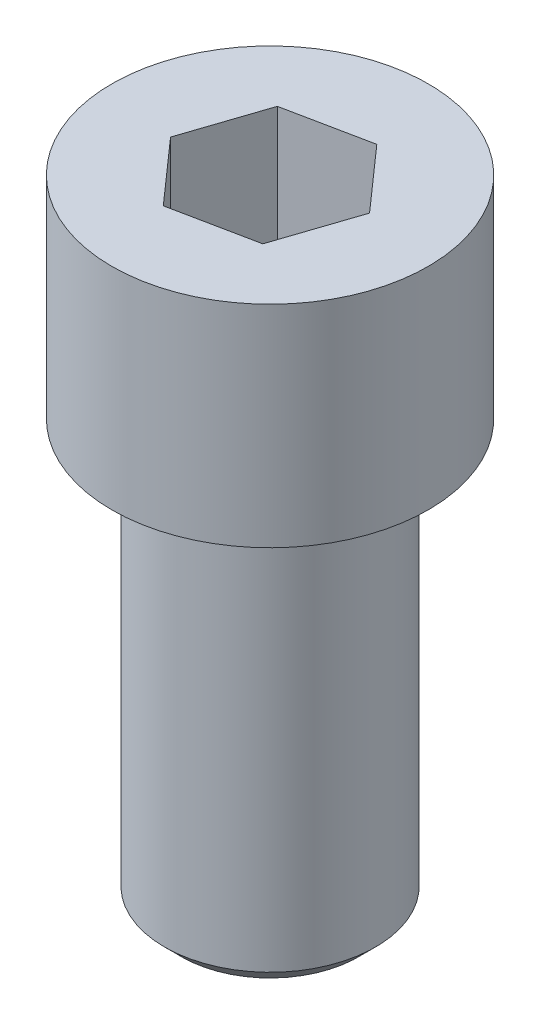
ISO-10303-21;
HEADER;
FILE_DESCRIPTION(('STEP AP214'),'2;1');
FILE_NAME('part.step','',(''),(''),'','','');
FILE_SCHEMA(('AUTOMOTIVE_DESIGN { 1 0 10303 214 1 1 1 1 }'));
ENDSEC;
DATA;
#1=APPLICATION_CONTEXT('core data for automotive mechanical design processes');
#2=APPLICATION_PROTOCOL_DEFINITION('international standard','automotive_design',2000,#1);
#3=PRODUCT_CONTEXT('',#1,'mechanical');
#4=PRODUCT('Part','Part','',(#3));
#5=PRODUCT_RELATED_PRODUCT_CATEGORY('part','',(#4));
#6=PRODUCT_DEFINITION_FORMATION('','',#4);
#7=PRODUCT_DEFINITION_CONTEXT('part definition',#1,'design');
#8=PRODUCT_DEFINITION('design','',#6,#7);
#9=PRODUCT_DEFINITION_SHAPE('','',#8);
#10=(LENGTH_UNIT() NAMED_UNIT(*) SI_UNIT(.MILLI.,.METRE.));
#11=(NAMED_UNIT(*) PLANE_ANGLE_UNIT() SI_UNIT($,.RADIAN.));
#12=(NAMED_UNIT(*) SI_UNIT($,.STERADIAN.) SOLID_ANGLE_UNIT());
#13=UNCERTAINTY_MEASURE_WITH_UNIT(LENGTH_MEASURE(1.E-05),#10,'distance_accuracy_value','');
#14=(GEOMETRIC_REPRESENTATION_CONTEXT(3) GLOBAL_UNCERTAINTY_ASSIGNED_CONTEXT((#13)) GLOBAL_UNIT_ASSIGNED_CONTEXT((#10,
#11,#12)) REPRESENTATION_CONTEXT('',''));
#15=CARTESIAN_POINT('',(0.,0.,0.));
#16=DIRECTION('',(0.,0.,1.));
#17=DIRECTION('',(1.,0.,0.));
#18=AXIS2_PLACEMENT_3D('',#15,#16,#17);
#19=CARTESIAN_POINT('',(0.,2.5,0.));
#20=DIRECTION('',(0.,-1.,0.));
#21=DIRECTION('',(0.,0.,-1.));
#22=AXIS2_PLACEMENT_3D('',#19,#20,#21);
#23=CYLINDRICAL_SURFACE('',#22,1.875);
#24=CARTESIAN_POINT('',(0.,2.5,0.));
#25=DIRECTION('',(0.,1.,0.));
#26=DIRECTION('',(0.,0.,1.));
#27=AXIS2_PLACEMENT_3D('',#24,#25,#26);
#28=CIRCLE('',#27,1.875);
#29=CARTESIAN_POINT('',(0.,2.5,1.875));
#30=VERTEX_POINT('',#29);
#31=EDGE_CURVE('E167',#30,#30,#28,.T.);
#32=ORIENTED_EDGE('',*,*,#31,.F.);
#33=EDGE_LOOP('',(#32));
#34=FACE_BOUND('',#33,.T.);
#35=CARTESIAN_POINT('',(0.,0.,0.));
#36=DIRECTION('',(0.,1.,0.));
#37=DIRECTION('',(0.,0.,1.));
#38=AXIS2_PLACEMENT_3D('',#35,#36,#37);
#39=CIRCLE('',#38,1.875);
#40=CARTESIAN_POINT('',(0.,0.,1.875));
#41=VERTEX_POINT('',#40);
#42=EDGE_CURVE('E157',#41,#41,#39,.T.);
#43=ORIENTED_EDGE('',*,*,#42,.T.);
#44=EDGE_LOOP('',(#43));
#45=FACE_BOUND('',#44,.T.);
#46=ADVANCED_FACE('F41',(#34,#45),#23,.T.);
#47=CARTESIAN_POINT('',(0.,2.5,0.));
#48=DIRECTION('',(0.,1.,0.));
#49=DIRECTION('',(0.,0.,1.));
#50=AXIS2_PLACEMENT_3D('',#47,#48,#49);
#51=PLANE('',#50);
#52=DIRECTION('',(-0.317225802511598,0.,0.948350035704577));
#53=VECTOR('',#52,1.);
#54=CARTESIAN_POINT('',(-0.662682321344245,2.5,-0.748900621563238));
#55=LINE('',#54,#53);
#56=CARTESIAN_POINT('',(-0.662682321344245,2.5,-0.748900621563238));
#57=VERTEX_POINT('',#56);
#58=CARTESIAN_POINT('',(-0.979908123855842,2.5,0.199449414141339));
#59=VERTEX_POINT('',#58);
#60=EDGE_CURVE('E58',#57,#59,#55,.T.);
#61=ORIENTED_EDGE('',*,*,#60,.F.);
#62=DIRECTION('',(-0.979908123855842,0.,0.199449414141339));
#63=VECTOR('',#62,1.);
#64=CARTESIAN_POINT('',(0.317225802511598,2.5,-0.948350035704577));
#65=LINE('',#64,#63);
#66=CARTESIAN_POINT('',(0.317225802511598,2.5,-0.948350035704577));
#67=VERTEX_POINT('',#66);
#68=EDGE_CURVE('E151',#67,#57,#65,.T.);
#69=ORIENTED_EDGE('',*,*,#68,.F.);
#70=DIRECTION('',(-0.662682321344244,0.,-0.748900621563238));
#71=VECTOR('',#70,1.);
#72=CARTESIAN_POINT('',(0.979908123855842,2.5,-0.199449414141339));
#73=LINE('',#72,#71);
#74=CARTESIAN_POINT('',(0.979908123855842,2.5,-0.199449414141339));
#75=VERTEX_POINT('',#74);
#76=EDGE_CURVE('E148',#75,#67,#73,.T.);
#77=ORIENTED_EDGE('',*,*,#76,.F.);
#78=DIRECTION('',(0.317225802511598,0.,-0.948350035704577));
#79=VECTOR('',#78,1.);
#80=CARTESIAN_POINT('',(0.662682321344244,2.5,0.748900621563238));
#81=LINE('',#80,#79);
#82=CARTESIAN_POINT('',(0.662682321344244,2.5,0.748900621563238));
#83=VERTEX_POINT('',#82);
#84=EDGE_CURVE('E106',#83,#75,#81,.T.);
#85=ORIENTED_EDGE('',*,*,#84,.F.);
#86=DIRECTION('',(0.979908123855842,0.,-0.199449414141339));
#87=VECTOR('',#86,1.);
#88=CARTESIAN_POINT('',(-0.317225802511598,2.5,0.948350035704577));
#89=LINE('',#88,#87);
#90=CARTESIAN_POINT('',(-0.317225802511598,2.5,0.948350035704577));
#91=VERTEX_POINT('',#90);
#92=EDGE_CURVE('E142',#91,#83,#89,.T.);
#93=ORIENTED_EDGE('',*,*,#92,.F.);
#94=DIRECTION('',(0.662682321344244,0.,0.748900621563238));
#95=VECTOR('',#94,1.);
#96=CARTESIAN_POINT('',(-0.979908123855842,2.5,0.199449414141339));
#97=LINE('',#96,#95);
#98=EDGE_CURVE('E138',#59,#91,#97,.T.);
#99=ORIENTED_EDGE('',*,*,#98,.F.);
#100=EDGE_LOOP('',(#61,#69,#77,#85,#93,#99));
#101=FACE_BOUND('',#100,.T.);
#102=ORIENTED_EDGE('',*,*,#31,.T.);
#103=EDGE_LOOP('',(#102));
#104=FACE_BOUND('',#103,.T.);
#105=ADVANCED_FACE('F200',(#101,#104),#51,.T.);
#106=CARTESIAN_POINT('',(0.,0.,0.));
#107=DIRECTION('',(0.,1.,0.));
#108=DIRECTION('',(0.,0.,1.));
#109=AXIS2_PLACEMENT_3D('',#106,#107,#108);
#110=PLANE('',#109);
#111=CARTESIAN_POINT('',(0.,0.,0.));
#112=DIRECTION('',(0.,1.,0.));
#113=DIRECTION('',(0.,0.,1.));
#114=AXIS2_PLACEMENT_3D('',#111,#112,#113);
#115=CIRCLE('',#114,1.4);
#116=CARTESIAN_POINT('',(0.,0.,1.4));
#117=VERTEX_POINT('',#116);
#118=EDGE_CURVE('E178',#117,#117,#115,.T.);
#119=ORIENTED_EDGE('',*,*,#118,.T.);
#120=EDGE_LOOP('',(#119));
#121=FACE_BOUND('',#120,.T.);
#122=ORIENTED_EDGE('',*,*,#42,.F.);
#123=EDGE_LOOP('',(#122));
#124=FACE_BOUND('',#123,.T.);
#125=ADVANCED_FACE('F206',(#121,#124),#110,.F.);
#126=CARTESIAN_POINT('',(0.,-5.,0.));
#127=DIRECTION('',(0.,1.,0.));
#128=DIRECTION('',(0.,0.,1.));
#129=AXIS2_PLACEMENT_3D('',#126,#127,#128);
#130=CYLINDRICAL_SURFACE('',#129,1.25);
#131=CARTESIAN_POINT('',(0.,-4.8,0.));
#132=DIRECTION('',(0.,-1.,0.));
#133=DIRECTION('',(0.,0.,-1.));
#134=AXIS2_PLACEMENT_3D('',#131,#132,#133);
#135=CIRCLE('',#134,1.25);
#136=CARTESIAN_POINT('',(0.,-4.8,-1.25));
#137=VERTEX_POINT('',#136);
#138=EDGE_CURVE('E11',#137,#137,#135,.F.);
#139=ORIENTED_EDGE('',*,*,#138,.T.);
#140=EDGE_LOOP('',(#139));
#141=FACE_BOUND('',#140,.T.);
#142=CARTESIAN_POINT('',(0.,-0.15,0.));
#143=DIRECTION('',(0.,1.,0.));
#144=DIRECTION('',(0.,0.,1.));
#145=AXIS2_PLACEMENT_3D('',#142,#143,#144);
#146=CIRCLE('',#145,1.25);
#147=CARTESIAN_POINT('',(0.,-0.15,1.25));
#148=VERTEX_POINT('',#147);
#149=EDGE_CURVE('E171',#148,#148,#146,.F.);
#150=ORIENTED_EDGE('',*,*,#149,.T.);
#151=EDGE_LOOP('',(#150));
#152=FACE_BOUND('',#151,.T.);
#153=ADVANCED_FACE('F213',(#141,#152),#130,.T.);
#154=CARTESIAN_POINT('',(0.,-5.,0.));
#155=DIRECTION('',(0.,-1.,0.));
#156=DIRECTION('',(0.,0.,-1.));
#157=AXIS2_PLACEMENT_3D('',#154,#155,#156);
#158=PLANE('',#157);
#159=CARTESIAN_POINT('',(0.,-5.,0.));
#160=DIRECTION('',(0.,-1.,0.));
#161=DIRECTION('',(0.,0.,-1.));
#162=AXIS2_PLACEMENT_3D('',#159,#160,#161);
#163=CIRCLE('',#162,1.05);
#164=CARTESIAN_POINT('',(0.,-5.,-1.05));
#165=VERTEX_POINT('',#164);
#166=EDGE_CURVE('E51',#165,#165,#163,.T.);
#167=ORIENTED_EDGE('',*,*,#166,.T.);
#168=EDGE_LOOP('',(#167));
#169=FACE_BOUND('',#168,.T.);
#170=ADVANCED_FACE('F185',(#169),#158,.T.);
#171=CARTESIAN_POINT('',(0.,-0.15,0.));
#172=DIRECTION('',(0.,1.,0.));
#173=DIRECTION('',(0.,0.,1.));
#174=AXIS2_PLACEMENT_3D('',#171,#172,#173);
#175=TOROIDAL_SURFACE('',#174,1.4,0.15);
#176=ORIENTED_EDGE('',*,*,#118,.F.);
#177=EDGE_LOOP('',(#176));
#178=FACE_BOUND('',#177,.T.);
#179=ORIENTED_EDGE('',*,*,#149,.F.);
#180=EDGE_LOOP('',(#179));
#181=FACE_BOUND('',#180,.T.);
#182=ADVANCED_FACE('F189',(#178,#181),#175,.F.);
#183=CARTESIAN_POINT('',(0.,-5.,0.));
#184=DIRECTION('',(0.,1.,0.));
#185=DIRECTION('',(0.,0.,1.));
#186=AXIS2_PLACEMENT_3D('',#183,#184,#185);
#187=CONICAL_SURFACE('',#186,1.05,0.785398163397448);
#188=ORIENTED_EDGE('',*,*,#138,.F.);
#189=EDGE_LOOP('',(#188));
#190=FACE_BOUND('',#189,.T.);
#191=ORIENTED_EDGE('',*,*,#166,.F.);
#192=EDGE_LOOP('',(#191));
#193=FACE_BOUND('',#192,.T.);
#194=ADVANCED_FACE('F44',(#190,#193),#187,.T.);
#195=CARTESIAN_POINT('',(-0.662682321344245,1.,-0.748900621563238));
#196=DIRECTION('',(-0.948350035704577,0.,-0.317225802511598));
#197=DIRECTION('',(-0.317225802511598,0.,0.948350035704577));
#198=AXIS2_PLACEMENT_3D('',#195,#196,#197);
#199=PLANE('',#198);
#200=ORIENTED_EDGE('',*,*,#60,.T.);
#201=DIRECTION('',(0.,1.,0.));
#202=VECTOR('',#201,1.);
#203=CARTESIAN_POINT('',(-0.979908123855842,1.,0.199449414141339));
#204=LINE('',#203,#202);
#205=CARTESIAN_POINT('',(-0.979908123855842,1.,0.199449414141339));
#206=VERTEX_POINT('',#205);
#207=EDGE_CURVE('E88',#206,#59,#204,.T.);
#208=ORIENTED_EDGE('',*,*,#207,.F.);
#209=DIRECTION('',(-0.317225802511598,0.,0.948350035704577));
#210=VECTOR('',#209,1.);
#211=CARTESIAN_POINT('',(-0.662682321344245,1.,-0.748900621563238));
#212=LINE('',#211,#210);
#213=CARTESIAN_POINT('',(-0.662682321344245,1.,-0.748900621563238));
#214=VERTEX_POINT('',#213);
#215=EDGE_CURVE('E154',#214,#206,#212,.T.);
#216=ORIENTED_EDGE('',*,*,#215,.F.);
#217=DIRECTION('',(0.,1.,0.));
#218=VECTOR('',#217,1.);
#219=CARTESIAN_POINT('',(-0.662682321344245,1.,-0.748900621563238));
#220=LINE('',#219,#218);
#221=EDGE_CURVE('E66',#214,#57,#220,.T.);
#222=ORIENTED_EDGE('',*,*,#221,.T.);
#223=EDGE_LOOP('',(#200,#208,#216,#222));
#224=FACE_BOUND('',#223,.T.);
#225=ADVANCED_FACE('F188',(#224),#199,.F.);
#226=CARTESIAN_POINT('',(0.317225802511598,1.,-0.948350035704577));
#227=DIRECTION('',(-0.199449414141339,0.,-0.979908123855842));
#228=DIRECTION('',(-0.979908123855842,0.,0.199449414141339));
#229=AXIS2_PLACEMENT_3D('',#226,#227,#228);
#230=PLANE('',#229);
#231=ORIENTED_EDGE('',*,*,#68,.T.);
#232=ORIENTED_EDGE('',*,*,#221,.F.);
#233=DIRECTION('',(-0.979908123855842,0.,0.199449414141339));
#234=VECTOR('',#233,1.);
#235=CARTESIAN_POINT('',(0.317225802511598,1.,-0.948350035704577));
#236=LINE('',#235,#234);
#237=CARTESIAN_POINT('',(0.317225802511598,1.,-0.948350035704577));
#238=VERTEX_POINT('',#237);
#239=EDGE_CURVE('E120',#238,#214,#236,.T.);
#240=ORIENTED_EDGE('',*,*,#239,.F.);
#241=DIRECTION('',(0.,1.,0.));
#242=VECTOR('',#241,1.);
#243=CARTESIAN_POINT('',(0.317225802511598,1.,-0.948350035704577));
#244=LINE('',#243,#242);
#245=EDGE_CURVE('E111',#238,#67,#244,.T.);
#246=ORIENTED_EDGE('',*,*,#245,.T.);
#247=EDGE_LOOP('',(#231,#232,#240,#246));
#248=FACE_BOUND('',#247,.T.);
#249=ADVANCED_FACE('F195',(#248),#230,.F.);
#250=CARTESIAN_POINT('',(0.979908123855842,1.,-0.199449414141339));
#251=DIRECTION('',(0.748900621563238,0.,-0.662682321344244));
#252=DIRECTION('',(-0.662682321344244,0.,-0.748900621563238));
#253=AXIS2_PLACEMENT_3D('',#250,#251,#252);
#254=PLANE('',#253);
#255=ORIENTED_EDGE('',*,*,#76,.T.);
#256=ORIENTED_EDGE('',*,*,#245,.F.);
#257=DIRECTION('',(-0.662682321344244,0.,-0.748900621563238));
#258=VECTOR('',#257,1.);
#259=CARTESIAN_POINT('',(0.979908123855842,1.,-0.199449414141339));
#260=LINE('',#259,#258);
#261=CARTESIAN_POINT('',(0.979908123855842,1.,-0.199449414141339));
#262=VERTEX_POINT('',#261);
#263=EDGE_CURVE('E115',#262,#238,#260,.T.);
#264=ORIENTED_EDGE('',*,*,#263,.F.);
#265=DIRECTION('',(0.,1.,0.));
#266=VECTOR('',#265,1.);
#267=CARTESIAN_POINT('',(0.979908123855842,1.,-0.199449414141339));
#268=LINE('',#267,#266);
#269=EDGE_CURVE('E99',#262,#75,#268,.T.);
#270=ORIENTED_EDGE('',*,*,#269,.T.);
#271=EDGE_LOOP('',(#255,#256,#264,#270));
#272=FACE_BOUND('',#271,.T.);
#273=ADVANCED_FACE('F116',(#272),#254,.F.);
#274=CARTESIAN_POINT('',(0.662682321344244,1.,0.748900621563238));
#275=DIRECTION('',(0.948350035704577,0.,0.317225802511598));
#276=DIRECTION('',(0.317225802511598,0.,-0.948350035704577));
#277=AXIS2_PLACEMENT_3D('',#274,#275,#276);
#278=PLANE('',#277);
#279=ORIENTED_EDGE('',*,*,#84,.T.);
#280=ORIENTED_EDGE('',*,*,#269,.F.);
#281=DIRECTION('',(0.317225802511598,0.,-0.948350035704577));
#282=VECTOR('',#281,1.);
#283=CARTESIAN_POINT('',(0.662682321344244,1.,0.748900621563238));
#284=LINE('',#283,#282);
#285=CARTESIAN_POINT('',(0.662682321344244,1.,0.748900621563238));
#286=VERTEX_POINT('',#285);
#287=EDGE_CURVE('E103',#286,#262,#284,.T.);
#288=ORIENTED_EDGE('',*,*,#287,.F.);
#289=DIRECTION('',(0.,1.,0.));
#290=VECTOR('',#289,1.);
#291=CARTESIAN_POINT('',(0.662682321344244,1.,0.748900621563238));
#292=LINE('',#291,#290);
#293=EDGE_CURVE('E112',#286,#83,#292,.T.);
#294=ORIENTED_EDGE('',*,*,#293,.T.);
#295=EDGE_LOOP('',(#279,#280,#288,#294));
#296=FACE_BOUND('',#295,.T.);
#297=ADVANCED_FACE('F101',(#296),#278,.F.);
#298=CARTESIAN_POINT('',(-0.317225802511598,1.,0.948350035704577));
#299=DIRECTION('',(0.199449414141339,0.,0.979908123855842));
#300=DIRECTION('',(0.979908123855842,0.,-0.199449414141339));
#301=AXIS2_PLACEMENT_3D('',#298,#299,#300);
#302=PLANE('',#301);
#303=ORIENTED_EDGE('',*,*,#92,.T.);
#304=ORIENTED_EDGE('',*,*,#293,.F.);
#305=DIRECTION('',(0.979908123855842,0.,-0.199449414141339));
#306=VECTOR('',#305,1.);
#307=CARTESIAN_POINT('',(-0.317225802511598,1.,0.948350035704577));
#308=LINE('',#307,#306);
#309=CARTESIAN_POINT('',(-0.317225802511598,1.,0.948350035704577));
#310=VERTEX_POINT('',#309);
#311=EDGE_CURVE('E126',#310,#286,#308,.T.);
#312=ORIENTED_EDGE('',*,*,#311,.F.);
#313=DIRECTION('',(0.,1.,0.));
#314=VECTOR('',#313,1.);
#315=CARTESIAN_POINT('',(-0.317225802511598,1.,0.948350035704577));
#316=LINE('',#315,#314);
#317=EDGE_CURVE('E162',#310,#91,#316,.T.);
#318=ORIENTED_EDGE('',*,*,#317,.T.);
#319=EDGE_LOOP('',(#303,#304,#312,#318));
#320=FACE_BOUND('',#319,.T.);
#321=ADVANCED_FACE('F224',(#320),#302,.F.);
#322=CARTESIAN_POINT('',(-0.979908123855842,1.,0.199449414141339));
#323=DIRECTION('',(-0.748900621563238,0.,0.662682321344244));
#324=DIRECTION('',(0.662682321344244,0.,0.748900621563238));
#325=AXIS2_PLACEMENT_3D('',#322,#323,#324);
#326=PLANE('',#325);
#327=ORIENTED_EDGE('',*,*,#98,.T.);
#328=ORIENTED_EDGE('',*,*,#317,.F.);
#329=DIRECTION('',(0.662682321344244,0.,0.748900621563238));
#330=VECTOR('',#329,1.);
#331=CARTESIAN_POINT('',(-0.979908123855842,1.,0.199449414141339));
#332=LINE('',#331,#330);
#333=EDGE_CURVE('E130',#206,#310,#332,.T.);
#334=ORIENTED_EDGE('',*,*,#333,.F.);
#335=ORIENTED_EDGE('',*,*,#207,.T.);
#336=EDGE_LOOP('',(#327,#328,#334,#335));
#337=FACE_BOUND('',#336,.T.);
#338=ADVANCED_FACE('F221',(#337),#326,.F.);
#339=CARTESIAN_POINT('',(0.,1.,0.));
#340=DIRECTION('',(0.,1.,0.));
#341=DIRECTION('',(0.,0.,1.));
#342=AXIS2_PLACEMENT_3D('',#339,#340,#341);
#343=PLANE('',#342);
#344=ORIENTED_EDGE('',*,*,#215,.T.);
#345=ORIENTED_EDGE('',*,*,#333,.T.);
#346=ORIENTED_EDGE('',*,*,#311,.T.);
#347=ORIENTED_EDGE('',*,*,#287,.T.);
#348=ORIENTED_EDGE('',*,*,#263,.T.);
#349=ORIENTED_EDGE('',*,*,#239,.T.);
#350=EDGE_LOOP('',(#344,#345,#346,#347,#348,#349));
#351=FACE_BOUND('',#350,.T.);
#352=ADVANCED_FACE('F123',(#351),#343,.T.);
#353=CLOSED_SHELL('',(#46,#105,#125,#153,#170,#182,#194,#225,#249,#273,#297,#321,#338,#352));
#354=MANIFOLD_SOLID_BREP('B2',#353);
#355=ADVANCED_BREP_SHAPE_REPRESENTATION('',(#18,#354),#14);
#356=SHAPE_DEFINITION_REPRESENTATION(#9,#355);
ENDSEC;
END-ISO-10303-21;
